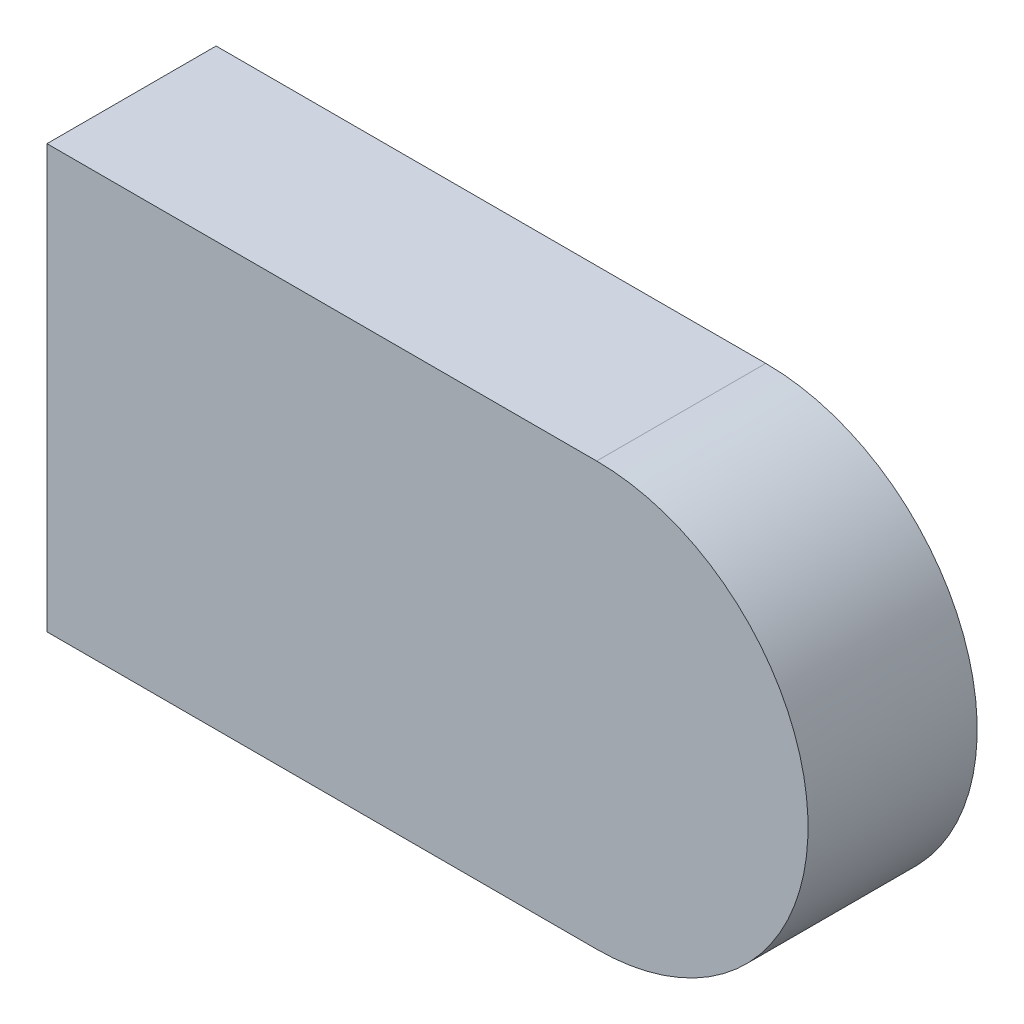
ISO-10303-21;
HEADER;
FILE_DESCRIPTION(('STEP AP214'),'2;1');
FILE_NAME('part.step','',(''),(''),'','','');
FILE_SCHEMA(('AUTOMOTIVE_DESIGN { 1 0 10303 214 1 1 1 1 }'));
ENDSEC;
DATA;
#1=APPLICATION_CONTEXT('core data for automotive mechanical design processes');
#2=APPLICATION_PROTOCOL_DEFINITION('international standard','automotive_design',2000,#1);
#3=PRODUCT_CONTEXT('',#1,'mechanical');
#4=PRODUCT('Part','Part','',(#3));
#5=PRODUCT_RELATED_PRODUCT_CATEGORY('part','',(#4));
#6=PRODUCT_DEFINITION_FORMATION('','',#4);
#7=PRODUCT_DEFINITION_CONTEXT('part definition',#1,'design');
#8=PRODUCT_DEFINITION('design','',#6,#7);
#9=PRODUCT_DEFINITION_SHAPE('','',#8);
#10=(LENGTH_UNIT() NAMED_UNIT(*) SI_UNIT(.MILLI.,.METRE.));
#11=(NAMED_UNIT(*) PLANE_ANGLE_UNIT() SI_UNIT($,.RADIAN.));
#12=(NAMED_UNIT(*) SI_UNIT($,.STERADIAN.) SOLID_ANGLE_UNIT());
#13=UNCERTAINTY_MEASURE_WITH_UNIT(LENGTH_MEASURE(1.E-05),#10,'distance_accuracy_value','');
#14=(GEOMETRIC_REPRESENTATION_CONTEXT(3) GLOBAL_UNCERTAINTY_ASSIGNED_CONTEXT((#13)) GLOBAL_UNIT_ASSIGNED_CONTEXT((#10,
#11,#12)) REPRESENTATION_CONTEXT('',''));
#15=CARTESIAN_POINT('',(0.,0.,0.));
#16=DIRECTION('',(0.,0.,1.));
#17=DIRECTION('',(1.,0.,0.));
#18=AXIS2_PLACEMENT_3D('',#15,#16,#17);
#19=CARTESIAN_POINT('',(-2.05,0.125,0.));
#20=DIRECTION('',(0.,1.,0.));
#21=DIRECTION('',(1.,0.,0.));
#22=AXIS2_PLACEMENT_3D('',#19,#20,#21);
#23=PLANE('',#22);
#24=DIRECTION('',(1.,0.,0.));
#25=VECTOR('',#24,1.);
#26=CARTESIAN_POINT('',(-2.05,0.125,0.));
#27=LINE('',#26,#25);
#28=CARTESIAN_POINT('',(-2.05,0.125,0.));
#29=VERTEX_POINT('',#28);
#30=CARTESIAN_POINT('',(-1.725,0.125,0.));
#31=VERTEX_POINT('',#30);
#32=EDGE_CURVE('E11',#29,#31,#27,.T.);
#33=ORIENTED_EDGE('',*,*,#32,.T.);
#34=DIRECTION('',(0.,0.,1.));
#35=VECTOR('',#34,1.);
#36=CARTESIAN_POINT('',(-1.725,0.125,0.));
#37=LINE('',#36,#35);
#38=CARTESIAN_POINT('',(-1.725,0.125,0.1));
#39=VERTEX_POINT('',#38);
#40=EDGE_CURVE('E24',#31,#39,#37,.T.);
#41=ORIENTED_EDGE('',*,*,#40,.T.);
#42=DIRECTION('',(1.,0.,0.));
#43=VECTOR('',#42,1.);
#44=CARTESIAN_POINT('',(-2.05,0.125,0.1));
#45=LINE('',#44,#43);
#46=CARTESIAN_POINT('',(-2.05,0.125,0.1));
#47=VERTEX_POINT('',#46);
#48=EDGE_CURVE('E88',#47,#39,#45,.T.);
#49=ORIENTED_EDGE('',*,*,#48,.F.);
#50=DIRECTION('',(0.,0.,1.));
#51=VECTOR('',#50,1.);
#52=CARTESIAN_POINT('',(-2.05,0.125,0.));
#53=LINE('',#52,#51);
#54=EDGE_CURVE('E36',#29,#47,#53,.T.);
#55=ORIENTED_EDGE('',*,*,#54,.F.);
#56=EDGE_LOOP('',(#33,#41,#49,#55));
#57=FACE_BOUND('',#56,.T.);
#58=ADVANCED_FACE('F17',(#57),#23,.F.);
#59=CARTESIAN_POINT('',(-1.725,0.25,0.));
#60=DIRECTION('',(0.,0.,-1.));
#61=DIRECTION('',(1.,0.,0.));
#62=AXIS2_PLACEMENT_3D('',#59,#60,#61);
#63=CYLINDRICAL_SURFACE('',#62,0.125);
#64=CARTESIAN_POINT('',(-1.725,0.25,0.));
#65=DIRECTION('',(0.,0.,1.));
#66=DIRECTION('',(1.,0.,0.));
#67=AXIS2_PLACEMENT_3D('',#64,#65,#66);
#68=CIRCLE('',#67,0.125);
#69=CARTESIAN_POINT('',(-1.725,0.375,0.));
#70=VERTEX_POINT('',#69);
#71=EDGE_CURVE('E85',#31,#70,#68,.T.);
#72=ORIENTED_EDGE('',*,*,#71,.T.);
#73=DIRECTION('',(0.,0.,1.));
#74=VECTOR('',#73,1.);
#75=CARTESIAN_POINT('',(-1.725,0.375,0.));
#76=LINE('',#75,#74);
#77=CARTESIAN_POINT('',(-1.725,0.375,0.1));
#78=VERTEX_POINT('',#77);
#79=EDGE_CURVE('E73',#70,#78,#76,.T.);
#80=ORIENTED_EDGE('',*,*,#79,.T.);
#81=CARTESIAN_POINT('',(-1.725,0.25,0.1));
#82=DIRECTION('',(0.,0.,1.));
#83=DIRECTION('',(1.,0.,0.));
#84=AXIS2_PLACEMENT_3D('',#81,#82,#83);
#85=CIRCLE('',#84,0.125);
#86=EDGE_CURVE('E66',#39,#78,#85,.T.);
#87=ORIENTED_EDGE('',*,*,#86,.F.);
#88=ORIENTED_EDGE('',*,*,#40,.F.);
#89=EDGE_LOOP('',(#72,#80,#87,#88));
#90=FACE_BOUND('',#89,.T.);
#91=ADVANCED_FACE('F89',(#90),#63,.T.);
#92=CARTESIAN_POINT('',(-2.05,0.375,0.));
#93=DIRECTION('',(0.,1.,0.));
#94=DIRECTION('',(1.,0.,0.));
#95=AXIS2_PLACEMENT_3D('',#92,#93,#94);
#96=PLANE('',#95);
#97=DIRECTION('',(0.,0.,1.));
#98=VECTOR('',#97,1.);
#99=CARTESIAN_POINT('',(-2.05,0.375,0.));
#100=LINE('',#99,#98);
#101=CARTESIAN_POINT('',(-2.05,0.375,0.));
#102=VERTEX_POINT('',#101);
#103=CARTESIAN_POINT('',(-2.05,0.375,0.1));
#104=VERTEX_POINT('',#103);
#105=EDGE_CURVE('E56',#102,#104,#100,.T.);
#106=ORIENTED_EDGE('',*,*,#105,.T.);
#107=DIRECTION('',(1.,0.,0.));
#108=VECTOR('',#107,1.);
#109=CARTESIAN_POINT('',(-2.05,0.375,0.1));
#110=LINE('',#109,#108);
#111=EDGE_CURVE('E67',#104,#78,#110,.T.);
#112=ORIENTED_EDGE('',*,*,#111,.T.);
#113=ORIENTED_EDGE('',*,*,#79,.F.);
#114=DIRECTION('',(1.,0.,0.));
#115=VECTOR('',#114,1.);
#116=CARTESIAN_POINT('',(-2.05,0.375,0.));
#117=LINE('',#116,#115);
#118=EDGE_CURVE('E71',#102,#70,#117,.T.);
#119=ORIENTED_EDGE('',*,*,#118,.F.);
#120=EDGE_LOOP('',(#106,#112,#113,#119));
#121=FACE_BOUND('',#120,.T.);
#122=ADVANCED_FACE('F72',(#121),#96,.T.);
#123=CARTESIAN_POINT('',(-2.05,0.125,0.));
#124=DIRECTION('',(-1.,0.,0.));
#125=DIRECTION('',(0.,1.,0.));
#126=AXIS2_PLACEMENT_3D('',#123,#124,#125);
#127=PLANE('',#126);
#128=ORIENTED_EDGE('',*,*,#54,.T.);
#129=DIRECTION('',(0.,1.,0.));
#130=VECTOR('',#129,1.);
#131=CARTESIAN_POINT('',(-2.05,0.125,0.1));
#132=LINE('',#131,#130);
#133=EDGE_CURVE('E62',#47,#104,#132,.T.);
#134=ORIENTED_EDGE('',*,*,#133,.T.);
#135=ORIENTED_EDGE('',*,*,#105,.F.);
#136=DIRECTION('',(0.,1.,0.));
#137=VECTOR('',#136,1.);
#138=CARTESIAN_POINT('',(-2.05,0.125,0.));
#139=LINE('',#138,#137);
#140=EDGE_CURVE('E60',#29,#102,#139,.T.);
#141=ORIENTED_EDGE('',*,*,#140,.F.);
#142=EDGE_LOOP('',(#128,#134,#135,#141));
#143=FACE_BOUND('',#142,.T.);
#144=ADVANCED_FACE('F58',(#143),#127,.T.);
#145=CARTESIAN_POINT('',(-1.850342514613,0.25,0.));
#146=DIRECTION('',(0.,0.,1.));
#147=DIRECTION('',(1.,0.,0.));
#148=AXIS2_PLACEMENT_3D('',#145,#146,#147);
#149=PLANE('',#148);
#150=ORIENTED_EDGE('',*,*,#140,.T.);
#151=ORIENTED_EDGE('',*,*,#118,.T.);
#152=ORIENTED_EDGE('',*,*,#71,.F.);
#153=ORIENTED_EDGE('',*,*,#32,.F.);
#154=EDGE_LOOP('',(#150,#151,#152,#153));
#155=FACE_BOUND('',#154,.T.);
#156=ADVANCED_FACE('F77',(#155),#149,.F.);
#157=CARTESIAN_POINT('',(-1.850342514613,0.25,0.1));
#158=DIRECTION('',(0.,0.,1.));
#159=DIRECTION('',(1.,0.,0.));
#160=AXIS2_PLACEMENT_3D('',#157,#158,#159);
#161=PLANE('',#160);
#162=ORIENTED_EDGE('',*,*,#48,.T.);
#163=ORIENTED_EDGE('',*,*,#86,.T.);
#164=ORIENTED_EDGE('',*,*,#111,.F.);
#165=ORIENTED_EDGE('',*,*,#133,.F.);
#166=EDGE_LOOP('',(#162,#163,#164,#165));
#167=FACE_BOUND('',#166,.T.);
#168=ADVANCED_FACE('F91',(#167),#161,.T.);
#169=CLOSED_SHELL('',(#58,#91,#122,#144,#156,#168));
#170=MANIFOLD_SOLID_BREP('B1',#169);
#171=ADVANCED_BREP_SHAPE_REPRESENTATION('',(#18,#170),#14);
#172=SHAPE_DEFINITION_REPRESENTATION(#9,#171);
ENDSEC;
END-ISO-10303-21;
